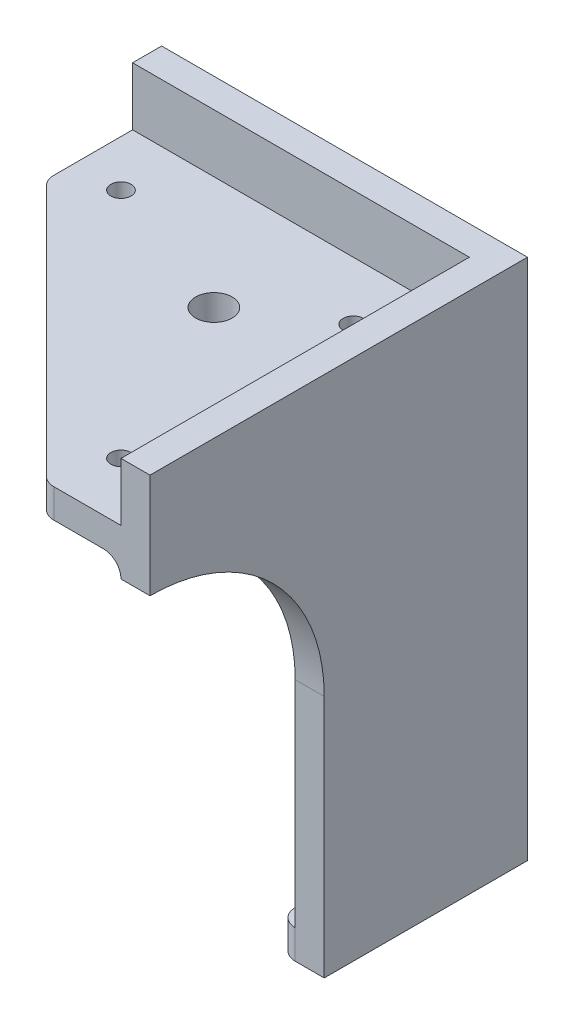
ISO-10303-21;
HEADER;
FILE_DESCRIPTION(('STEP AP214'),'2;1');
FILE_NAME('part.step','',(''),(''),'','','');
FILE_SCHEMA(('AUTOMOTIVE_DESIGN { 1 0 10303 214 1 1 1 1 }'));
ENDSEC;
DATA;
#1=APPLICATION_CONTEXT('core data for automotive mechanical design processes');
#2=APPLICATION_PROTOCOL_DEFINITION('international standard','automotive_design',2000,#1);
#3=PRODUCT_CONTEXT('',#1,'mechanical');
#4=PRODUCT('Part','Part','',(#3));
#5=PRODUCT_RELATED_PRODUCT_CATEGORY('part','',(#4));
#6=PRODUCT_DEFINITION_FORMATION('','',#4);
#7=PRODUCT_DEFINITION_CONTEXT('part definition',#1,'design');
#8=PRODUCT_DEFINITION('design','',#6,#7);
#9=PRODUCT_DEFINITION_SHAPE('','',#8);
#10=(LENGTH_UNIT() NAMED_UNIT(*) SI_UNIT(.MILLI.,.METRE.));
#11=(NAMED_UNIT(*) PLANE_ANGLE_UNIT() SI_UNIT($,.RADIAN.));
#12=(NAMED_UNIT(*) SI_UNIT($,.STERADIAN.) SOLID_ANGLE_UNIT());
#13=UNCERTAINTY_MEASURE_WITH_UNIT(LENGTH_MEASURE(1.E-05),#10,'distance_accuracy_value','');
#14=(GEOMETRIC_REPRESENTATION_CONTEXT(3) GLOBAL_UNCERTAINTY_ASSIGNED_CONTEXT((#13)) GLOBAL_UNIT_ASSIGNED_CONTEXT((#10,
#11,#12)) REPRESENTATION_CONTEXT('',''));
#15=CARTESIAN_POINT('',(0.,0.,0.));
#16=DIRECTION('',(0.,0.,1.));
#17=DIRECTION('',(1.,0.,0.));
#18=AXIS2_PLACEMENT_3D('',#15,#16,#17);
#19=CARTESIAN_POINT('',(-63.,-48.,5.));
#20=DIRECTION('',(0.,0.,1.));
#21=DIRECTION('',(1.,0.,0.));
#22=AXIS2_PLACEMENT_3D('',#19,#20,#21);
#23=PLANE('',#22);
#24=DIRECTION('',(0.,-1.,0.));
#25=VECTOR('',#24,1.);
#26=CARTESIAN_POINT('',(-7.99999999999996,-48.,5.));
#27=LINE('',#26,#25);
#28=CARTESIAN_POINT('',(-7.99999999999996,-85.,5.));
#29=VERTEX_POINT('',#28);
#30=CARTESIAN_POINT('',(-7.99999999999997,-18.,5.));
#31=VERTEX_POINT('',#30);
#32=EDGE_CURVE('E322',#29,#31,#27,.F.);
#33=ORIENTED_EDGE('',*,*,#32,.T.);
#34=DIRECTION('',(1.,0.,0.));
#35=VECTOR('',#34,1.);
#36=CARTESIAN_POINT('',(-63.,-18.,5.));
#37=LINE('',#36,#35);
#38=CARTESIAN_POINT('',(-63.,-18.,5.));
#39=VERTEX_POINT('',#38);
#40=EDGE_CURVE('E324',#31,#39,#37,.F.);
#41=ORIENTED_EDGE('',*,*,#40,.T.);
#42=CARTESIAN_POINT('',(-63.,-48.,5.));
#43=DIRECTION('',(0.,0.,-1.));
#44=DIRECTION('',(1.,0.,0.));
#45=AXIS2_PLACEMENT_3D('',#42,#43,#44);
#46=CIRCLE('',#45,30.);
#47=CARTESIAN_POINT('',(-33.,-48.,5.));
#48=VERTEX_POINT('',#47);
#49=EDGE_CURVE('E234',#39,#48,#46,.T.);
#50=ORIENTED_EDGE('',*,*,#49,.T.);
#51=DIRECTION('',(0.,-1.,0.));
#52=VECTOR('',#51,1.);
#53=CARTESIAN_POINT('',(-33.,-90.,5.));
#54=LINE('',#53,#52);
#55=CARTESIAN_POINT('',(-33.,-85.,5.));
#56=VERTEX_POINT('',#55);
#57=EDGE_CURVE('E237',#48,#56,#54,.T.);
#58=ORIENTED_EDGE('',*,*,#57,.T.);
#59=DIRECTION('',(1.,0.,0.));
#60=VECTOR('',#59,1.);
#61=CARTESIAN_POINT('',(-33.,-85.,5.));
#62=LINE('',#61,#60);
#63=EDGE_CURVE('E356',#56,#29,#62,.T.);
#64=ORIENTED_EDGE('',*,*,#63,.T.);
#65=EDGE_LOOP('',(#33,#41,#50,#58,#64));
#66=FACE_BOUND('',#65,.T.);
#67=ADVANCED_FACE('F33',(#66),#23,.T.);
#68=DIRECTION('',(0.,-1.,0.));
#69=VECTOR('',#68,1.);
#70=CARTESIAN_POINT('',(-63.,-18.,5.));
#71=LINE('',#70,#69);
#72=CARTESIAN_POINT('',(-63.,0.,5.));
#73=VERTEX_POINT('',#72);
#74=CARTESIAN_POINT('',(-63.,-10.,5.));
#75=VERTEX_POINT('',#74);
#76=EDGE_CURVE('E206',#73,#75,#71,.T.);
#77=ORIENTED_EDGE('',*,*,#76,.T.);
#78=DIRECTION('',(-1.,0.,0.));
#79=VECTOR('',#78,1.);
#80=CARTESIAN_POINT('',(-4.99999999999996,-10.,5.));
#81=LINE('',#80,#79);
#82=CARTESIAN_POINT('',(-4.99999999999996,-10.,5.));
#83=VERTEX_POINT('',#82);
#84=EDGE_CURVE('E190',#83,#75,#81,.T.);
#85=ORIENTED_EDGE('',*,*,#84,.F.);
#86=DIRECTION('',(0.,-1.,0.));
#87=VECTOR('',#86,1.);
#88=CARTESIAN_POINT('',(-4.99999999999997,0.,5.));
#89=LINE('',#88,#87);
#90=CARTESIAN_POINT('',(-4.99999999999996,0.,5.));
#91=VERTEX_POINT('',#90);
#92=EDGE_CURVE('E203',#91,#83,#89,.T.);
#93=ORIENTED_EDGE('',*,*,#92,.F.);
#94=DIRECTION('',(-1.,0.,0.));
#95=VECTOR('',#94,1.);
#96=CARTESIAN_POINT('',(-63.,0.,5.));
#97=LINE('',#96,#95);
#98=EDGE_CURVE('E224',#91,#73,#97,.T.);
#99=ORIENTED_EDGE('',*,*,#98,.T.);
#100=EDGE_LOOP('',(#77,#85,#93,#99));
#101=FACE_BOUND('',#100,.T.);
#102=ADVANCED_FACE('F202',(#101),#23,.T.);
#103=CARTESIAN_POINT('',(-4.99999999999997,0.,65.));
#104=DIRECTION('',(1.,0.,0.));
#105=DIRECTION('',(0.,1.,0.));
#106=AXIS2_PLACEMENT_3D('',#103,#104,#105);
#107=PLANE('',#106);
#108=CARTESIAN_POINT('',(-4.99999999999998,-48.,65.));
#109=DIRECTION('',(1.,0.,0.));
#110=DIRECTION('',(0.,1.,0.));
#111=AXIS2_PLACEMENT_3D('',#108,#109,#110);
#112=CIRCLE('',#111,30.);
#113=CARTESIAN_POINT('',(-4.99999999999998,-18.,65.));
#114=VERTEX_POINT('',#113);
#115=CARTESIAN_POINT('',(-4.99999999999997,-48.,35.));
#116=VERTEX_POINT('',#115);
#117=EDGE_CURVE('E215',#114,#116,#112,.F.);
#118=ORIENTED_EDGE('',*,*,#117,.F.);
#119=DIRECTION('',(0.,0.,-1.));
#120=VECTOR('',#119,1.);
#121=CARTESIAN_POINT('',(-4.99999999999997,-18.,5.));
#122=LINE('',#121,#120);
#123=CARTESIAN_POINT('',(-4.99999999999997,-18.,8.));
#124=VERTEX_POINT('',#123);
#125=EDGE_CURVE('E50',#114,#124,#122,.T.);
#126=ORIENTED_EDGE('',*,*,#125,.T.);
#127=DIRECTION('',(0.,-1.,0.));
#128=VECTOR('',#127,1.);
#129=CARTESIAN_POINT('',(-4.99999999999997,0.,8.));
#130=LINE('',#129,#128);
#131=CARTESIAN_POINT('',(-4.99999999999996,-85.,8.));
#132=VERTEX_POINT('',#131);
#133=EDGE_CURVE('E54',#124,#132,#130,.T.);
#134=ORIENTED_EDGE('',*,*,#133,.T.);
#135=DIRECTION('',(0.,0.,1.));
#136=VECTOR('',#135,1.);
#137=CARTESIAN_POINT('',(-4.99999999999996,-85.,5.));
#138=LINE('',#137,#136);
#139=CARTESIAN_POINT('',(-4.99999999999996,-85.,35.));
#140=VERTEX_POINT('',#139);
#141=EDGE_CURVE('E359',#132,#140,#138,.T.);
#142=ORIENTED_EDGE('',*,*,#141,.T.);
#143=DIRECTION('',(0.,-1.,0.));
#144=VECTOR('',#143,1.);
#145=CARTESIAN_POINT('',(-4.99999999999996,-90.,35.));
#146=LINE('',#145,#144);
#147=EDGE_CURVE('E219',#116,#140,#146,.T.);
#148=ORIENTED_EDGE('',*,*,#147,.F.);
#149=EDGE_LOOP('',(#118,#126,#134,#142,#148));
#150=FACE_BOUND('',#149,.T.);
#151=ADVANCED_FACE('F427',(#150),#107,.F.);
#152=DIRECTION('',(0.,0.,-1.));
#153=VECTOR('',#152,1.);
#154=CARTESIAN_POINT('',(-4.99999999999996,-10.,123.215118311312));
#155=LINE('',#154,#153);
#156=CARTESIAN_POINT('',(-4.99999999999996,-10.,65.));
#157=VERTEX_POINT('',#156);
#158=EDGE_CURVE('E185',#157,#83,#155,.T.);
#159=ORIENTED_EDGE('',*,*,#158,.F.);
#160=DIRECTION('',(0.,-1.,0.));
#161=VECTOR('',#160,1.);
#162=CARTESIAN_POINT('',(-4.99999999999997,0.,65.));
#163=LINE('',#162,#161);
#164=CARTESIAN_POINT('',(-4.99999999999997,0.,65.));
#165=VERTEX_POINT('',#164);
#166=EDGE_CURVE('E231',#165,#157,#163,.T.);
#167=ORIENTED_EDGE('',*,*,#166,.F.);
#168=DIRECTION('',(0.,0.,-1.));
#169=VECTOR('',#168,1.);
#170=CARTESIAN_POINT('',(-4.99999999999997,0.,65.));
#171=LINE('',#170,#169);
#172=EDGE_CURVE('E213',#165,#91,#171,.T.);
#173=ORIENTED_EDGE('',*,*,#172,.T.);
#174=ORIENTED_EDGE('',*,*,#92,.T.);
#175=EDGE_LOOP('',(#159,#167,#173,#174));
#176=FACE_BOUND('',#175,.T.);
#177=ADVANCED_FACE('F211',(#176),#107,.F.);
#178=CARTESIAN_POINT('',(-63.,-18.,5.));
#179=DIRECTION('',(1.,0.,0.));
#180=DIRECTION('',(0.,1.,0.));
#181=AXIS2_PLACEMENT_3D('',#178,#179,#180);
#182=PLANE('',#181);
#183=DIRECTION('',(0.,0.,-1.));
#184=VECTOR('',#183,1.);
#185=CARTESIAN_POINT('',(-63.,-15.,123.215118311312));
#186=LINE('',#185,#184);
#187=CARTESIAN_POINT('',(-63.,-15.,18.575));
#188=VERTEX_POINT('',#187);
#189=CARTESIAN_POINT('',(-63.,-15.,8.00000000000004));
#190=VERTEX_POINT('',#189);
#191=EDGE_CURVE('E207',#188,#190,#186,.T.);
#192=ORIENTED_EDGE('',*,*,#191,.F.);
#193=DIRECTION('',(0.,1.,0.));
#194=VECTOR('',#193,1.);
#195=CARTESIAN_POINT('',(-63.,-18.,18.575));
#196=LINE('',#195,#194);
#197=CARTESIAN_POINT('',(-63.,-10.,18.575));
#198=VERTEX_POINT('',#197);
#199=EDGE_CURVE('E314',#188,#198,#196,.T.);
#200=ORIENTED_EDGE('',*,*,#199,.T.);
#201=DIRECTION('',(0.,0.,-1.));
#202=VECTOR('',#201,1.);
#203=CARTESIAN_POINT('',(-63.,-10.,123.215118311312));
#204=LINE('',#203,#202);
#205=EDGE_CURVE('E199',#198,#75,#204,.T.);
#206=ORIENTED_EDGE('',*,*,#205,.T.);
#207=ORIENTED_EDGE('',*,*,#76,.F.);
#208=DIRECTION('',(0.,0.,-1.));
#209=VECTOR('',#208,1.);
#210=CARTESIAN_POINT('',(-63.,0.,5.));
#211=LINE('',#210,#209);
#212=CARTESIAN_POINT('',(-63.,0.,0.));
#213=VERTEX_POINT('',#212);
#214=EDGE_CURVE('E255',#73,#213,#211,.T.);
#215=ORIENTED_EDGE('',*,*,#214,.T.);
#216=DIRECTION('',(0.,-1.,0.));
#217=VECTOR('',#216,1.);
#218=CARTESIAN_POINT('',(-63.,-18.,0.));
#219=LINE('',#218,#217);
#220=CARTESIAN_POINT('',(-63.,-18.,0.));
#221=VERTEX_POINT('',#220);
#222=EDGE_CURVE('E241',#213,#221,#219,.T.);
#223=ORIENTED_EDGE('',*,*,#222,.T.);
#224=DIRECTION('',(0.,0.,-1.));
#225=VECTOR('',#224,1.);
#226=CARTESIAN_POINT('',(-63.,-18.,5.));
#227=LINE('',#226,#225);
#228=EDGE_CURVE('E267',#39,#221,#227,.T.);
#229=ORIENTED_EDGE('',*,*,#228,.F.);
#230=CARTESIAN_POINT('',(-63.,-18.,8.00000000000001));
#231=DIRECTION('',(1.,0.,0.));
#232=DIRECTION('',(0.,1.,0.));
#233=AXIS2_PLACEMENT_3D('',#230,#231,#232);
#234=CIRCLE('',#233,3.);
#235=EDGE_CURVE('E42',#39,#190,#234,.T.);
#236=ORIENTED_EDGE('',*,*,#235,.T.);
#237=EDGE_LOOP('',(#192,#200,#206,#207,#215,#223,#229,#236));
#238=FACE_BOUND('',#237,.T.);
#239=ADVANCED_FACE('F404',(#238),#182,.F.);
#240=CARTESIAN_POINT('',(-63.,-48.,5.));
#241=DIRECTION('',(0.,0.,-1.));
#242=DIRECTION('',(-1.,0.,0.));
#243=AXIS2_PLACEMENT_3D('',#240,#241,#242);
#244=CYLINDRICAL_SURFACE('',#243,30.);
#245=CARTESIAN_POINT('',(-63.,-48.,0.));
#246=DIRECTION('',(0.,0.,-1.));
#247=DIRECTION('',(1.,0.,0.));
#248=AXIS2_PLACEMENT_3D('',#245,#246,#247);
#249=CIRCLE('',#248,30.);
#250=CARTESIAN_POINT('',(-33.,-48.,0.));
#251=VERTEX_POINT('',#250);
#252=EDGE_CURVE('E244',#221,#251,#249,.T.);
#253=ORIENTED_EDGE('',*,*,#252,.T.);
#254=DIRECTION('',(0.,0.,-1.));
#255=VECTOR('',#254,1.);
#256=CARTESIAN_POINT('',(-33.,-48.,5.));
#257=LINE('',#256,#255);
#258=EDGE_CURVE('E265',#48,#251,#257,.T.);
#259=ORIENTED_EDGE('',*,*,#258,.F.);
#260=ORIENTED_EDGE('',*,*,#49,.F.);
#261=ORIENTED_EDGE('',*,*,#228,.T.);
#262=EDGE_LOOP('',(#253,#259,#260,#261));
#263=FACE_BOUND('',#262,.T.);
#264=ADVANCED_FACE('F450',(#263),#244,.F.);
#265=CARTESIAN_POINT('',(-33.,-90.,5.));
#266=DIRECTION('',(1.,0.,0.));
#267=DIRECTION('',(0.,0.,-1.));
#268=AXIS2_PLACEMENT_3D('',#265,#266,#267);
#269=PLANE('',#268);
#270=DIRECTION('',(0.,0.,-1.));
#271=VECTOR('',#270,1.);
#272=CARTESIAN_POINT('',(-33.,-90.,5.));
#273=LINE('',#272,#271);
#274=CARTESIAN_POINT('',(-33.,-90.,5.));
#275=VERTEX_POINT('',#274);
#276=CARTESIAN_POINT('',(-33.,-90.,0.));
#277=VERTEX_POINT('',#276);
#278=EDGE_CURVE('E263',#275,#277,#273,.T.);
#279=ORIENTED_EDGE('',*,*,#278,.F.);
#280=DIRECTION('',(0.,-1.,0.));
#281=VECTOR('',#280,1.);
#282=CARTESIAN_POINT('',(-33.,-85.,5.));
#283=LINE('',#282,#281);
#284=EDGE_CURVE('E286',#275,#56,#283,.F.);
#285=ORIENTED_EDGE('',*,*,#284,.T.);
#286=ORIENTED_EDGE('',*,*,#57,.F.);
#287=ORIENTED_EDGE('',*,*,#258,.T.);
#288=DIRECTION('',(0.,-1.,0.));
#289=VECTOR('',#288,1.);
#290=CARTESIAN_POINT('',(-33.,-90.,0.));
#291=LINE('',#290,#289);
#292=EDGE_CURVE('E246',#251,#277,#291,.T.);
#293=ORIENTED_EDGE('',*,*,#292,.T.);
#294=EDGE_LOOP('',(#279,#285,#286,#287,#293));
#295=FACE_BOUND('',#294,.T.);
#296=ADVANCED_FACE('F446',(#295),#269,.F.);
#297=CARTESIAN_POINT('',(0.,-90.,5.));
#298=DIRECTION('',(0.,1.,0.));
#299=DIRECTION('',(0.,0.,1.));
#300=AXIS2_PLACEMENT_3D('',#297,#298,#299);
#301=PLANE('',#300);
#302=DIRECTION('',(-1.,0.,0.));
#303=VECTOR('',#302,1.);
#304=CARTESIAN_POINT('',(-33.,-90.,8.));
#305=LINE('',#304,#303);
#306=CARTESIAN_POINT('',(-7.99999999999996,-90.,8.));
#307=VERTEX_POINT('',#306);
#308=CARTESIAN_POINT('',(-30.,-90.,8.));
#309=VERTEX_POINT('',#308);
#310=EDGE_CURVE('E360',#307,#309,#305,.T.);
#311=ORIENTED_EDGE('',*,*,#310,.T.);
#312=CARTESIAN_POINT('',(-30.,-90.,5.));
#313=DIRECTION('',(0.,1.,0.));
#314=DIRECTION('',(0.,0.,1.));
#315=AXIS2_PLACEMENT_3D('',#312,#313,#314);
#316=CIRCLE('',#315,3.);
#317=EDGE_CURVE('E281',#309,#275,#316,.F.);
#318=ORIENTED_EDGE('',*,*,#317,.T.);
#319=ORIENTED_EDGE('',*,*,#278,.T.);
#320=DIRECTION('',(1.,0.,0.));
#321=VECTOR('',#320,1.);
#322=CARTESIAN_POINT('',(0.,-90.,0.));
#323=LINE('',#322,#321);
#324=CARTESIAN_POINT('',(0.,-90.,0.));
#325=VERTEX_POINT('',#324);
#326=EDGE_CURVE('E249',#277,#325,#323,.T.);
#327=ORIENTED_EDGE('',*,*,#326,.T.);
#328=DIRECTION('',(0.,0.,-1.));
#329=VECTOR('',#328,1.);
#330=CARTESIAN_POINT('',(0.,-90.,5.));
#331=LINE('',#330,#329);
#332=CARTESIAN_POINT('',(0.,-90.,35.));
#333=VERTEX_POINT('',#332);
#334=EDGE_CURVE('E261',#333,#325,#331,.T.);
#335=ORIENTED_EDGE('',*,*,#334,.F.);
#336=DIRECTION('',(1.,0.,0.));
#337=VECTOR('',#336,1.);
#338=CARTESIAN_POINT('',(-82.9999999999999,-90.,35.));
#339=LINE('',#338,#337);
#340=CARTESIAN_POINT('',(-4.99999999999996,-90.,35.));
#341=VERTEX_POINT('',#340);
#342=EDGE_CURVE('E379',#341,#333,#339,.T.);
#343=ORIENTED_EDGE('',*,*,#342,.F.);
#344=CARTESIAN_POINT('',(-4.99999999999996,-90.,32.));
#345=DIRECTION('',(0.,1.,0.));
#346=DIRECTION('',(0.,0.,1.));
#347=AXIS2_PLACEMENT_3D('',#344,#345,#346);
#348=CIRCLE('',#347,3.);
#349=CARTESIAN_POINT('',(-7.99999999999996,-90.,32.));
#350=VERTEX_POINT('',#349);
#351=EDGE_CURVE('E274',#341,#350,#348,.F.);
#352=ORIENTED_EDGE('',*,*,#351,.T.);
#353=DIRECTION('',(0.,0.,-1.));
#354=VECTOR('',#353,1.);
#355=CARTESIAN_POINT('',(-7.99999999999996,-90.,8.));
#356=LINE('',#355,#354);
#357=EDGE_CURVE('E350',#350,#307,#356,.T.);
#358=ORIENTED_EDGE('',*,*,#357,.T.);
#359=EDGE_LOOP('',(#311,#318,#319,#327,#335,#343,#352,#358));
#360=FACE_BOUND('',#359,.T.);
#361=ADVANCED_FACE('F442',(#360),#301,.F.);
#362=CARTESIAN_POINT('',(0.,0.,5.));
#363=DIRECTION('',(-1.,0.,0.));
#364=DIRECTION('',(0.,-1.,0.));
#365=AXIS2_PLACEMENT_3D('',#362,#363,#364);
#366=PLANE('',#365);
#367=DIRECTION('',(0.,1.,0.));
#368=VECTOR('',#367,1.);
#369=CARTESIAN_POINT('',(0.,0.,65.));
#370=LINE('',#369,#368);
#371=CARTESIAN_POINT('',(0.,-18.,65.));
#372=VERTEX_POINT('',#371);
#373=CARTESIAN_POINT('',(0.,0.,65.));
#374=VERTEX_POINT('',#373);
#375=EDGE_CURVE('E214',#372,#374,#370,.T.);
#376=ORIENTED_EDGE('',*,*,#375,.F.);
#377=CARTESIAN_POINT('',(0.,-48.,65.));
#378=DIRECTION('',(1.,0.,0.));
#379=DIRECTION('',(0.,1.,0.));
#380=AXIS2_PLACEMENT_3D('',#377,#378,#379);
#381=CIRCLE('',#380,30.);
#382=CARTESIAN_POINT('',(0.,-48.,35.));
#383=VERTEX_POINT('',#382);
#384=EDGE_CURVE('E377',#383,#372,#381,.T.);
#385=ORIENTED_EDGE('',*,*,#384,.F.);
#386=DIRECTION('',(0.,1.,0.));
#387=VECTOR('',#386,1.);
#388=CARTESIAN_POINT('',(0.,-90.,35.));
#389=LINE('',#388,#387);
#390=EDGE_CURVE('E371',#333,#383,#389,.T.);
#391=ORIENTED_EDGE('',*,*,#390,.F.);
#392=ORIENTED_EDGE('',*,*,#334,.T.);
#393=DIRECTION('',(0.,1.,0.));
#394=VECTOR('',#393,1.);
#395=CARTESIAN_POINT('',(0.,0.,0.));
#396=LINE('',#395,#394);
#397=CARTESIAN_POINT('',(0.,0.,0.));
#398=VERTEX_POINT('',#397);
#399=EDGE_CURVE('E252',#325,#398,#396,.T.);
#400=ORIENTED_EDGE('',*,*,#399,.T.);
#401=DIRECTION('',(0.,0.,-1.));
#402=VECTOR('',#401,1.);
#403=CARTESIAN_POINT('',(0.,0.,5.));
#404=LINE('',#403,#402);
#405=EDGE_CURVE('E258',#374,#398,#404,.T.);
#406=ORIENTED_EDGE('',*,*,#405,.F.);
#407=EDGE_LOOP('',(#376,#385,#391,#392,#400,#406));
#408=FACE_BOUND('',#407,.T.);
#409=ADVANCED_FACE('F438',(#408),#366,.F.);
#410=CARTESIAN_POINT('',(-63.,0.,5.));
#411=DIRECTION('',(0.,-1.,0.));
#412=DIRECTION('',(0.,0.,-1.));
#413=AXIS2_PLACEMENT_3D('',#410,#411,#412);
#414=PLANE('',#413);
#415=DIRECTION('',(-1.,0.,0.));
#416=VECTOR('',#415,1.);
#417=CARTESIAN_POINT('',(-63.,0.,0.));
#418=LINE('',#417,#416);
#419=EDGE_CURVE('E235',#398,#213,#418,.T.);
#420=ORIENTED_EDGE('',*,*,#419,.T.);
#421=ORIENTED_EDGE('',*,*,#214,.F.);
#422=ORIENTED_EDGE('',*,*,#98,.F.);
#423=ORIENTED_EDGE('',*,*,#172,.F.);
#424=DIRECTION('',(-1.,0.,0.));
#425=VECTOR('',#424,1.);
#426=CARTESIAN_POINT('',(0.,0.,65.));
#427=LINE('',#426,#425);
#428=EDGE_CURVE('E217',#374,#165,#427,.T.);
#429=ORIENTED_EDGE('',*,*,#428,.F.);
#430=ORIENTED_EDGE('',*,*,#405,.T.);
#431=EDGE_LOOP('',(#420,#421,#422,#423,#429,#430));
#432=FACE_BOUND('',#431,.T.);
#433=ADVANCED_FACE('F434',(#432),#414,.F.);
#434=CARTESIAN_POINT('',(-63.,-48.,0.));
#435=DIRECTION('',(0.,0.,1.));
#436=DIRECTION('',(1.,0.,0.));
#437=AXIS2_PLACEMENT_3D('',#434,#435,#436);
#438=PLANE('',#437);
#439=ORIENTED_EDGE('',*,*,#222,.F.);
#440=ORIENTED_EDGE('',*,*,#419,.F.);
#441=ORIENTED_EDGE('',*,*,#399,.F.);
#442=ORIENTED_EDGE('',*,*,#326,.F.);
#443=ORIENTED_EDGE('',*,*,#292,.F.);
#444=ORIENTED_EDGE('',*,*,#252,.F.);
#445=EDGE_LOOP('',(#439,#440,#441,#442,#443,#444));
#446=FACE_BOUND('',#445,.T.);
#447=ADVANCED_FACE('F431',(#446),#438,.F.);
#448=CARTESIAN_POINT('',(0.,0.,65.));
#449=DIRECTION('',(0.,0.,-1.));
#450=DIRECTION('',(-1.,0.,0.));
#451=AXIS2_PLACEMENT_3D('',#448,#449,#450);
#452=PLANE('',#451);
#453=DIRECTION('',(1.,0.,0.));
#454=VECTOR('',#453,1.);
#455=CARTESIAN_POINT('',(-4.99999999999996,-10.,65.));
#456=LINE('',#455,#454);
#457=CARTESIAN_POINT('',(-16.5750000000005,-10.,65.));
#458=VERTEX_POINT('',#457);
#459=EDGE_CURVE('E193',#458,#157,#456,.T.);
#460=ORIENTED_EDGE('',*,*,#459,.F.);
#461=DIRECTION('',(0.,1.,0.));
#462=VECTOR('',#461,1.);
#463=CARTESIAN_POINT('',(-16.5750000000005,0.,65.));
#464=LINE('',#463,#462);
#465=CARTESIAN_POINT('',(-16.5750000000005,-15.,65.));
#466=VERTEX_POINT('',#465);
#467=EDGE_CURVE('E307',#458,#466,#464,.F.);
#468=ORIENTED_EDGE('',*,*,#467,.T.);
#469=DIRECTION('',(-1.,0.,0.));
#470=VECTOR('',#469,1.);
#471=CARTESIAN_POINT('',(-4.99999999999996,-15.,65.));
#472=LINE('',#471,#470);
#473=CARTESIAN_POINT('',(-7.99999999999997,-15.,65.));
#474=VERTEX_POINT('',#473);
#475=EDGE_CURVE('E198',#474,#466,#472,.T.);
#476=ORIENTED_EDGE('',*,*,#475,.F.);
#477=CARTESIAN_POINT('',(-7.99999999999997,-18.,65.));
#478=DIRECTION('',(0.,0.,-1.));
#479=DIRECTION('',(-1.,0.,0.));
#480=AXIS2_PLACEMENT_3D('',#477,#478,#479);
#481=CIRCLE('',#480,3.);
#482=EDGE_CURVE('E11',#474,#114,#481,.T.);
#483=ORIENTED_EDGE('',*,*,#482,.T.);
#484=DIRECTION('',(1.,0.,0.));
#485=VECTOR('',#484,1.);
#486=CARTESIAN_POINT('',(-83.,-18.,65.));
#487=LINE('',#486,#485);
#488=EDGE_CURVE('E373',#114,#372,#487,.T.);
#489=ORIENTED_EDGE('',*,*,#488,.T.);
#490=ORIENTED_EDGE('',*,*,#375,.T.);
#491=ORIENTED_EDGE('',*,*,#428,.T.);
#492=ORIENTED_EDGE('',*,*,#166,.T.);
#493=EDGE_LOOP('',(#460,#468,#476,#483,#489,#490,#491,#492));
#494=FACE_BOUND('',#493,.T.);
#495=ADVANCED_FACE('F386',(#494),#452,.F.);
#496=CARTESIAN_POINT('',(-82.9999999999999,-48.,65.));
#497=DIRECTION('',(1.,0.,0.));
#498=DIRECTION('',(0.,1.,0.));
#499=AXIS2_PLACEMENT_3D('',#496,#497,#498);
#500=CYLINDRICAL_SURFACE('',#499,30.);
#501=ORIENTED_EDGE('',*,*,#117,.T.);
#502=DIRECTION('',(1.,0.,0.));
#503=VECTOR('',#502,1.);
#504=CARTESIAN_POINT('',(-82.9999999999999,-48.,35.));
#505=LINE('',#504,#503);
#506=EDGE_CURVE('E382',#116,#383,#505,.T.);
#507=ORIENTED_EDGE('',*,*,#506,.T.);
#508=ORIENTED_EDGE('',*,*,#384,.T.);
#509=ORIENTED_EDGE('',*,*,#488,.F.);
#510=EDGE_LOOP('',(#501,#507,#508,#509));
#511=FACE_BOUND('',#510,.T.);
#512=ADVANCED_FACE('F574',(#511),#500,.F.);
#513=CARTESIAN_POINT('',(-82.9999999999999,-90.,35.));
#514=DIRECTION('',(0.,0.,-1.));
#515=DIRECTION('',(0.,1.,0.));
#516=AXIS2_PLACEMENT_3D('',#513,#514,#515);
#517=PLANE('',#516);
#518=ORIENTED_EDGE('',*,*,#147,.T.);
#519=DIRECTION('',(0.,-1.,0.));
#520=VECTOR('',#519,1.);
#521=CARTESIAN_POINT('',(-4.99999999999996,-90.,35.));
#522=LINE('',#521,#520);
#523=EDGE_CURVE('E293',#140,#341,#522,.T.);
#524=ORIENTED_EDGE('',*,*,#523,.T.);
#525=ORIENTED_EDGE('',*,*,#342,.T.);
#526=ORIENTED_EDGE('',*,*,#390,.T.);
#527=ORIENTED_EDGE('',*,*,#506,.F.);
#528=EDGE_LOOP('',(#518,#524,#525,#526,#527));
#529=FACE_BOUND('',#528,.T.);
#530=ADVANCED_FACE('F643',(#529),#517,.F.);
#531=CARTESIAN_POINT('',(-33.,-85.,8.));
#532=DIRECTION('',(0.,0.,1.));
#533=DIRECTION('',(1.,0.,0.));
#534=AXIS2_PLACEMENT_3D('',#531,#532,#533);
#535=PLANE('',#534);
#536=DIRECTION('',(-1.,0.,0.));
#537=VECTOR('',#536,1.);
#538=CARTESIAN_POINT('',(-33.,-85.,8.));
#539=LINE('',#538,#537);
#540=CARTESIAN_POINT('',(-7.99999999999996,-85.,8.));
#541=VERTEX_POINT('',#540);
#542=CARTESIAN_POINT('',(-30.,-85.,8.));
#543=VERTEX_POINT('',#542);
#544=EDGE_CURVE('E364',#541,#543,#539,.T.);
#545=ORIENTED_EDGE('',*,*,#544,.T.);
#546=DIRECTION('',(0.,-1.,0.));
#547=VECTOR('',#546,1.);
#548=CARTESIAN_POINT('',(-30.,-90.,8.));
#549=LINE('',#548,#547);
#550=EDGE_CURVE('E269',#543,#309,#549,.T.);
#551=ORIENTED_EDGE('',*,*,#550,.T.);
#552=ORIENTED_EDGE('',*,*,#310,.F.);
#553=DIRECTION('',(0.,-1.,0.));
#554=VECTOR('',#553,1.);
#555=CARTESIAN_POINT('',(-7.99999999999996,-85.,8.));
#556=LINE('',#555,#554);
#557=EDGE_CURVE('E366',#541,#307,#556,.T.);
#558=ORIENTED_EDGE('',*,*,#557,.F.);
#559=EDGE_LOOP('',(#545,#551,#552,#558));
#560=FACE_BOUND('',#559,.T.);
#561=ADVANCED_FACE('F634',(#560),#535,.T.);
#562=CARTESIAN_POINT('',(-7.99999999999996,-85.,8.));
#563=DIRECTION('',(-1.,0.,0.));
#564=DIRECTION('',(0.,-1.,0.));
#565=AXIS2_PLACEMENT_3D('',#562,#563,#564);
#566=PLANE('',#565);
#567=ORIENTED_EDGE('',*,*,#357,.F.);
#568=DIRECTION('',(0.,-1.,0.));
#569=VECTOR('',#568,1.);
#570=CARTESIAN_POINT('',(-7.99999999999996,-85.,32.));
#571=LINE('',#570,#569);
#572=CARTESIAN_POINT('',(-7.99999999999996,-85.,32.));
#573=VERTEX_POINT('',#572);
#574=EDGE_CURVE('E296',#350,#573,#571,.F.);
#575=ORIENTED_EDGE('',*,*,#574,.T.);
#576=DIRECTION('',(0.,0.,-1.));
#577=VECTOR('',#576,1.);
#578=CARTESIAN_POINT('',(-7.99999999999996,-85.,8.));
#579=LINE('',#578,#577);
#580=EDGE_CURVE('E362',#573,#541,#579,.T.);
#581=ORIENTED_EDGE('',*,*,#580,.T.);
#582=ORIENTED_EDGE('',*,*,#557,.T.);
#583=EDGE_LOOP('',(#567,#575,#581,#582));
#584=FACE_BOUND('',#583,.T.);
#585=ADVANCED_FACE('F626',(#584),#566,.T.);
#586=CARTESIAN_POINT('',(0.,-85.,0.));
#587=DIRECTION('',(0.,1.,0.));
#588=DIRECTION('',(0.,0.,1.));
#589=AXIS2_PLACEMENT_3D('',#586,#587,#588);
#590=PLANE('',#589);
#591=ORIENTED_EDGE('',*,*,#141,.F.);
#592=CARTESIAN_POINT('',(-7.99999999999996,-85.,8.));
#593=DIRECTION('',(0.,1.,0.));
#594=DIRECTION('',(0.,0.,1.));
#595=AXIS2_PLACEMENT_3D('',#592,#593,#594);
#596=CIRCLE('',#595,3.);
#597=EDGE_CURVE('E328',#132,#29,#596,.T.);
#598=ORIENTED_EDGE('',*,*,#597,.T.);
#599=ORIENTED_EDGE('',*,*,#63,.F.);
#600=CARTESIAN_POINT('',(-30.,-85.,5.));
#601=DIRECTION('',(0.,1.,0.));
#602=DIRECTION('',(0.,0.,1.));
#603=AXIS2_PLACEMENT_3D('',#600,#601,#602);
#604=CIRCLE('',#603,3.);
#605=EDGE_CURVE('E291',#56,#543,#604,.T.);
#606=ORIENTED_EDGE('',*,*,#605,.T.);
#607=ORIENTED_EDGE('',*,*,#544,.F.);
#608=ORIENTED_EDGE('',*,*,#580,.F.);
#609=CARTESIAN_POINT('',(-4.99999999999996,-85.,32.));
#610=DIRECTION('',(0.,1.,0.));
#611=DIRECTION('',(0.,0.,1.));
#612=AXIS2_PLACEMENT_3D('',#609,#610,#611);
#613=CIRCLE('',#612,3.);
#614=EDGE_CURVE('E288',#573,#140,#613,.T.);
#615=ORIENTED_EDGE('',*,*,#614,.T.);
#616=EDGE_LOOP('',(#591,#598,#599,#606,#607,#608,#615));
#617=FACE_BOUND('',#616,.T.);
#618=ADVANCED_FACE('F460',(#617),#590,.T.);
#619=CARTESIAN_POINT('',(-30.,-85.,5.));
#620=DIRECTION('',(0.,1.,0.));
#621=DIRECTION('',(0.,0.,1.));
#622=AXIS2_PLACEMENT_3D('',#619,#620,#621);
#623=CYLINDRICAL_SURFACE('',#622,3.);
#624=ORIENTED_EDGE('',*,*,#605,.F.);
#625=ORIENTED_EDGE('',*,*,#284,.F.);
#626=ORIENTED_EDGE('',*,*,#317,.F.);
#627=ORIENTED_EDGE('',*,*,#550,.F.);
#628=EDGE_LOOP('',(#624,#625,#626,#627));
#629=FACE_BOUND('',#628,.T.);
#630=ADVANCED_FACE('F456',(#629),#623,.T.);
#631=CARTESIAN_POINT('',(-4.99999999999996,-90.,32.));
#632=DIRECTION('',(0.,1.,0.));
#633=DIRECTION('',(0.,0.,1.));
#634=AXIS2_PLACEMENT_3D('',#631,#632,#633);
#635=CYLINDRICAL_SURFACE('',#634,3.);
#636=ORIENTED_EDGE('',*,*,#614,.F.);
#637=ORIENTED_EDGE('',*,*,#574,.F.);
#638=ORIENTED_EDGE('',*,*,#351,.F.);
#639=ORIENTED_EDGE('',*,*,#523,.F.);
#640=EDGE_LOOP('',(#636,#637,#638,#639));
#641=FACE_BOUND('',#640,.T.);
#642=ADVANCED_FACE('F459',(#641),#635,.T.);
#643=CARTESIAN_POINT('',(-4.99999999999996,-15.,123.215118311312));
#644=DIRECTION('',(0.,1.,0.));
#645=DIRECTION('',(-1.,0.,0.));
#646=AXIS2_PLACEMENT_3D('',#643,#644,#645);
#647=PLANE('',#646);
#648=CARTESIAN_POINT('',(-29.5,-15.,24.4999999999999));
#649=DIRECTION('',(0.,1.,0.));
#650=DIRECTION('',(-1.,0.,0.));
#651=AXIS2_PLACEMENT_3D('',#648,#649,#650);
#652=CIRCLE('',#651,3.15);
#653=CARTESIAN_POINT('',(-32.65,-15.,24.4999999999999));
#654=VERTEX_POINT('',#653);
#655=EDGE_CURVE('E759',#654,#654,#652,.F.);
#656=ORIENTED_EDGE('',*,*,#655,.F.);
#657=EDGE_LOOP('',(#656));
#658=FACE_BOUND('',#657,.T.);
#659=CARTESIAN_POINT('',(-55.,-15.,15.));
#660=DIRECTION('',(0.,1.,0.));
#661=DIRECTION('',(-1.,0.,0.));
#662=AXIS2_PLACEMENT_3D('',#659,#660,#661);
#663=CIRCLE('',#662,1.75);
#664=CARTESIAN_POINT('',(-56.75,-15.,15.));
#665=VERTEX_POINT('',#664);
#666=EDGE_CURVE('E763',#665,#665,#663,.F.);
#667=ORIENTED_EDGE('',*,*,#666,.F.);
#668=EDGE_LOOP('',(#667));
#669=FACE_BOUND('',#668,.T.);
#670=CARTESIAN_POINT('',(-15.,-15.,15.));
#671=DIRECTION('',(0.,1.,0.));
#672=DIRECTION('',(-1.,0.,0.));
#673=AXIS2_PLACEMENT_3D('',#670,#671,#672);
#674=CIRCLE('',#673,1.75);
#675=CARTESIAN_POINT('',(-16.75,-15.,15.));
#676=VERTEX_POINT('',#675);
#677=EDGE_CURVE('E767',#676,#676,#674,.F.);
#678=ORIENTED_EDGE('',*,*,#677,.F.);
#679=EDGE_LOOP('',(#678));
#680=FACE_BOUND('',#679,.T.);
#681=CARTESIAN_POINT('',(-15.,-15.,55.));
#682=DIRECTION('',(0.,1.,0.));
#683=DIRECTION('',(-1.,0.,0.));
#684=AXIS2_PLACEMENT_3D('',#681,#682,#683);
#685=CIRCLE('',#684,1.75);
#686=CARTESIAN_POINT('',(-16.75,-15.,55.));
#687=VERTEX_POINT('',#686);
#688=EDGE_CURVE('E333',#687,#687,#685,.F.);
#689=ORIENTED_EDGE('',*,*,#688,.F.);
#690=EDGE_LOOP('',(#689));
#691=FACE_BOUND('',#690,.T.);
#692=ORIENTED_EDGE('',*,*,#191,.T.);
#693=DIRECTION('',(1.,0.,0.));
#694=VECTOR('',#693,1.);
#695=CARTESIAN_POINT('',(-4.99999999999996,-15.,8.00000000000001));
#696=LINE('',#695,#694);
#697=CARTESIAN_POINT('',(-7.99999999999997,-15.,8.00000000000001));
#698=VERTEX_POINT('',#697);
#699=EDGE_CURVE('E319',#190,#698,#696,.T.);
#700=ORIENTED_EDGE('',*,*,#699,.T.);
#701=DIRECTION('',(0.,0.,-1.));
#702=VECTOR('',#701,1.);
#703=CARTESIAN_POINT('',(-7.99999999999997,-15.,65.));
#704=LINE('',#703,#702);
#705=EDGE_CURVE('E317',#698,#474,#704,.F.);
#706=ORIENTED_EDGE('',*,*,#705,.T.);
#707=ORIENTED_EDGE('',*,*,#475,.T.);
#708=CARTESIAN_POINT('',(-16.5750000000005,-15.,62.));
#709=DIRECTION('',(0.,1.,0.));
#710=DIRECTION('',(-1.,0.,0.));
#711=AXIS2_PLACEMENT_3D('',#708,#709,#710);
#712=CIRCLE('',#711,3.);
#713=CARTESIAN_POINT('',(-18.6963203435601,-15.,64.1213203435596));
#714=VERTEX_POINT('',#713);
#715=EDGE_CURVE('E312',#466,#714,#712,.F.);
#716=ORIENTED_EDGE('',*,*,#715,.T.);
#717=DIRECTION('',(0.707106781186544,0.,0.707106781186551));
#718=VECTOR('',#717,1.);
#719=CARTESIAN_POINT('',(-63.,-15.,19.8176406871193));
#720=LINE('',#719,#718);
#721=CARTESIAN_POINT('',(-62.1213203435597,-15.,20.6963203435596));
#722=VERTEX_POINT('',#721);
#723=EDGE_CURVE('E208',#722,#714,#720,.T.);
#724=ORIENTED_EDGE('',*,*,#723,.F.);
#725=CARTESIAN_POINT('',(-60.,-15.,18.575));
#726=DIRECTION('',(0.,1.,0.));
#727=DIRECTION('',(-1.,0.,0.));
#728=AXIS2_PLACEMENT_3D('',#725,#726,#727);
#729=CIRCLE('',#728,3.);
#730=EDGE_CURVE('E310',#722,#188,#729,.F.);
#731=ORIENTED_EDGE('',*,*,#730,.T.);
#732=EDGE_LOOP('',(#692,#700,#706,#707,#716,#724,#731));
#733=FACE_BOUND('',#732,.T.);
#734=ADVANCED_FACE('F395',(#658,#669,#680,#691,#733),#647,.F.);
#735=CARTESIAN_POINT('',(-4.99999999999996,-10.,123.215118311312));
#736=DIRECTION('',(0.,-1.,0.));
#737=DIRECTION('',(1.,0.,0.));
#738=AXIS2_PLACEMENT_3D('',#735,#736,#737);
#739=PLANE('',#738);
#740=CARTESIAN_POINT('',(-29.5,-10.,24.4999999999999));
#741=DIRECTION('',(0.,1.,0.));
#742=DIRECTION('',(-1.,0.,0.));
#743=AXIS2_PLACEMENT_3D('',#740,#741,#742);
#744=CIRCLE('',#743,3.15);
#745=CARTESIAN_POINT('',(-32.65,-10.,24.4999999999999));
#746=VERTEX_POINT('',#745);
#747=EDGE_CURVE('E783',#746,#746,#744,.T.);
#748=ORIENTED_EDGE('',*,*,#747,.F.);
#749=EDGE_LOOP('',(#748));
#750=FACE_BOUND('',#749,.T.);
#751=CARTESIAN_POINT('',(-55.,-10.,15.));
#752=DIRECTION('',(0.,1.,0.));
#753=DIRECTION('',(-1.,0.,0.));
#754=AXIS2_PLACEMENT_3D('',#751,#752,#753);
#755=CIRCLE('',#754,1.75);
#756=CARTESIAN_POINT('',(-56.75,-10.,15.));
#757=VERTEX_POINT('',#756);
#758=EDGE_CURVE('E779',#757,#757,#755,.T.);
#759=ORIENTED_EDGE('',*,*,#758,.F.);
#760=EDGE_LOOP('',(#759));
#761=FACE_BOUND('',#760,.T.);
#762=CARTESIAN_POINT('',(-15.,-10.,15.));
#763=DIRECTION('',(0.,1.,0.));
#764=DIRECTION('',(-1.,0.,0.));
#765=AXIS2_PLACEMENT_3D('',#762,#763,#764);
#766=CIRCLE('',#765,1.75);
#767=CARTESIAN_POINT('',(-16.75,-10.,15.));
#768=VERTEX_POINT('',#767);
#769=EDGE_CURVE('E775',#768,#768,#766,.T.);
#770=ORIENTED_EDGE('',*,*,#769,.F.);
#771=EDGE_LOOP('',(#770));
#772=FACE_BOUND('',#771,.T.);
#773=CARTESIAN_POINT('',(-15.,-10.,55.));
#774=DIRECTION('',(0.,1.,0.));
#775=DIRECTION('',(-1.,0.,0.));
#776=AXIS2_PLACEMENT_3D('',#773,#774,#775);
#777=CIRCLE('',#776,1.75);
#778=CARTESIAN_POINT('',(-16.75,-10.,55.));
#779=VERTEX_POINT('',#778);
#780=EDGE_CURVE('E770',#779,#779,#777,.T.);
#781=ORIENTED_EDGE('',*,*,#780,.F.);
#782=EDGE_LOOP('',(#781));
#783=FACE_BOUND('',#782,.T.);
#784=DIRECTION('',(-0.707106781186544,0.,-0.707106781186551));
#785=VECTOR('',#784,1.);
#786=CARTESIAN_POINT('',(-63.,-10.,19.8176406871193));
#787=LINE('',#786,#785);
#788=CARTESIAN_POINT('',(-18.6963203435601,-10.,64.1213203435596));
#789=VERTEX_POINT('',#788);
#790=CARTESIAN_POINT('',(-62.1213203435597,-10.,20.6963203435596));
#791=VERTEX_POINT('',#790);
#792=EDGE_CURVE('E339',#789,#791,#787,.T.);
#793=ORIENTED_EDGE('',*,*,#792,.F.);
#794=CARTESIAN_POINT('',(-16.5750000000005,-9.99999999999999,62.));
#795=DIRECTION('',(0.,-1.,0.));
#796=DIRECTION('',(1.,0.,0.));
#797=AXIS2_PLACEMENT_3D('',#794,#795,#796);
#798=CIRCLE('',#797,3.);
#799=EDGE_CURVE('E305',#789,#458,#798,.F.);
#800=ORIENTED_EDGE('',*,*,#799,.T.);
#801=ORIENTED_EDGE('',*,*,#459,.T.);
#802=ORIENTED_EDGE('',*,*,#158,.T.);
#803=ORIENTED_EDGE('',*,*,#84,.T.);
#804=ORIENTED_EDGE('',*,*,#205,.F.);
#805=CARTESIAN_POINT('',(-60.,-10.,18.575));
#806=DIRECTION('',(0.,-1.,0.));
#807=DIRECTION('',(1.,0.,0.));
#808=AXIS2_PLACEMENT_3D('',#805,#806,#807);
#809=CIRCLE('',#808,3.);
#810=EDGE_CURVE('E303',#198,#791,#809,.F.);
#811=ORIENTED_EDGE('',*,*,#810,.T.);
#812=EDGE_LOOP('',(#793,#800,#801,#802,#803,#804,#811));
#813=FACE_BOUND('',#812,.T.);
#814=ADVANCED_FACE('F188',(#750,#761,#772,#783,#813),#739,.F.);
#815=CARTESIAN_POINT('',(-63.,-78.8975053202899,19.8176406871193));
#816=DIRECTION('',(0.707106781186551,0.,-0.707106781186544));
#817=DIRECTION('',(-0.707106781186544,0.,-0.707106781186551));
#818=AXIS2_PLACEMENT_3D('',#815,#816,#817);
#819=PLANE('',#818);
#820=ORIENTED_EDGE('',*,*,#723,.T.);
#821=DIRECTION('',(0.,1.,0.));
#822=VECTOR('',#821,1.);
#823=CARTESIAN_POINT('',(-18.6963203435601,-78.8975053202899,64.1213203435596));
#824=LINE('',#823,#822);
#825=EDGE_CURVE('E300',#714,#789,#824,.T.);
#826=ORIENTED_EDGE('',*,*,#825,.T.);
#827=ORIENTED_EDGE('',*,*,#792,.T.);
#828=DIRECTION('',(0.,1.,0.));
#829=VECTOR('',#828,1.);
#830=CARTESIAN_POINT('',(-62.1213203435596,-78.8975053202899,20.6963203435597));
#831=LINE('',#830,#829);
#832=EDGE_CURVE('E298',#791,#722,#831,.F.);
#833=ORIENTED_EDGE('',*,*,#832,.T.);
#834=EDGE_LOOP('',(#820,#826,#827,#833));
#835=FACE_BOUND('',#834,.T.);
#836=ADVANCED_FACE('F397',(#835),#819,.F.);
#837=CARTESIAN_POINT('',(-16.5750000000004,-78.8975053202899,62.));
#838=DIRECTION('',(0.,1.,0.));
#839=DIRECTION('',(-1.,0.,0.));
#840=AXIS2_PLACEMENT_3D('',#837,#838,#839);
#841=CYLINDRICAL_SURFACE('',#840,3.);
#842=ORIENTED_EDGE('',*,*,#715,.F.);
#843=ORIENTED_EDGE('',*,*,#467,.F.);
#844=ORIENTED_EDGE('',*,*,#799,.F.);
#845=ORIENTED_EDGE('',*,*,#825,.F.);
#846=EDGE_LOOP('',(#842,#843,#844,#845));
#847=FACE_BOUND('',#846,.T.);
#848=ADVANCED_FACE('F391',(#847),#841,.T.);
#849=CARTESIAN_POINT('',(-60.,-18.,18.575));
#850=DIRECTION('',(0.,1.,0.));
#851=DIRECTION('',(-1.,0.,0.));
#852=AXIS2_PLACEMENT_3D('',#849,#850,#851);
#853=CYLINDRICAL_SURFACE('',#852,3.);
#854=ORIENTED_EDGE('',*,*,#730,.F.);
#855=ORIENTED_EDGE('',*,*,#832,.F.);
#856=ORIENTED_EDGE('',*,*,#810,.F.);
#857=ORIENTED_EDGE('',*,*,#199,.F.);
#858=EDGE_LOOP('',(#854,#855,#856,#857));
#859=FACE_BOUND('',#858,.T.);
#860=ADVANCED_FACE('F399',(#859),#853,.T.);
#861=CARTESIAN_POINT('',(-7.99999999999997,-18.,65.));
#862=DIRECTION('',(0.,0.,1.));
#863=DIRECTION('',(1.,0.,0.));
#864=AXIS2_PLACEMENT_3D('',#861,#862,#863);
#865=CYLINDRICAL_SURFACE('',#864,3.);
#866=ORIENTED_EDGE('',*,*,#482,.F.);
#867=ORIENTED_EDGE('',*,*,#705,.F.);
#868=CARTESIAN_POINT('',(-7.99999999999997,-18.,8.));
#869=DIRECTION('',(0.,0.,1.));
#870=DIRECTION('',(0.,-1.,0.));
#871=AXIS2_PLACEMENT_3D('',#868,#869,#870);
#872=CIRCLE('',#871,3.);
#873=EDGE_CURVE('E37',#124,#698,#872,.T.);
#874=ORIENTED_EDGE('',*,*,#873,.F.);
#875=ORIENTED_EDGE('',*,*,#125,.F.);
#876=EDGE_LOOP('',(#866,#867,#874,#875));
#877=FACE_BOUND('',#876,.T.);
#878=ADVANCED_FACE('F35',(#877),#865,.F.);
#879=CARTESIAN_POINT('',(-7.99999999999997,0.,8.));
#880=DIRECTION('',(0.,-1.,0.));
#881=DIRECTION('',(1.,0.,0.));
#882=AXIS2_PLACEMENT_3D('',#879,#880,#881);
#883=CYLINDRICAL_SURFACE('',#882,3.);
#884=ORIENTED_EDGE('',*,*,#597,.F.);
#885=ORIENTED_EDGE('',*,*,#133,.F.);
#886=CARTESIAN_POINT('',(-7.99999999999997,-18.,8.));
#887=DIRECTION('',(0.,-1.,0.));
#888=DIRECTION('',(1.,0.,0.));
#889=AXIS2_PLACEMENT_3D('',#886,#887,#888);
#890=CIRCLE('',#889,3.);
#891=EDGE_CURVE('E332',#31,#124,#890,.T.);
#892=ORIENTED_EDGE('',*,*,#891,.F.);
#893=ORIENTED_EDGE('',*,*,#32,.F.);
#894=EDGE_LOOP('',(#884,#885,#892,#893));
#895=FACE_BOUND('',#894,.T.);
#896=ADVANCED_FACE('F413',(#895),#883,.F.);
#897=CARTESIAN_POINT('',(-7.99999999999997,-18.,8.));
#898=DIRECTION('',(0.,0.,1.));
#899=DIRECTION('',(1.,0.,0.));
#900=AXIS2_PLACEMENT_3D('',#897,#898,#899);
#901=SPHERICAL_SURFACE('',#900,3.);
#902=ORIENTED_EDGE('',*,*,#891,.T.);
#903=ORIENTED_EDGE('',*,*,#873,.T.);
#904=CARTESIAN_POINT('',(-7.99999999999997,-18.,8.00000000000001));
#905=DIRECTION('',(-1.,0.,0.));
#906=DIRECTION('',(0.,0.,1.));
#907=AXIS2_PLACEMENT_3D('',#904,#905,#906);
#908=CIRCLE('',#907,3.);
#909=EDGE_CURVE('E331',#31,#698,#908,.F.);
#910=ORIENTED_EDGE('',*,*,#909,.F.);
#911=EDGE_LOOP('',(#902,#903,#910));
#912=FACE_BOUND('',#911,.T.);
#913=ADVANCED_FACE('F418',(#912),#901,.F.);
#914=CARTESIAN_POINT('',(-4.99999999999996,-18.,8.00000000000001));
#915=DIRECTION('',(1.,0.,0.));
#916=DIRECTION('',(0.,1.,0.));
#917=AXIS2_PLACEMENT_3D('',#914,#915,#916);
#918=CYLINDRICAL_SURFACE('',#917,3.);
#919=ORIENTED_EDGE('',*,*,#235,.F.);
#920=ORIENTED_EDGE('',*,*,#40,.F.);
#921=ORIENTED_EDGE('',*,*,#909,.T.);
#922=ORIENTED_EDGE('',*,*,#699,.F.);
#923=EDGE_LOOP('',(#919,#920,#921,#922));
#924=FACE_BOUND('',#923,.T.);
#925=ADVANCED_FACE('F408',(#924),#918,.F.);
#926=CARTESIAN_POINT('',(-15.,-23.9095454429505,55.));
#927=DIRECTION('',(0.,1.,0.));
#928=DIRECTION('',(-1.,0.,0.));
#929=AXIS2_PLACEMENT_3D('',#926,#927,#928);
#930=CYLINDRICAL_SURFACE('',#929,1.75);
#931=ORIENTED_EDGE('',*,*,#688,.T.);
#932=EDGE_LOOP('',(#931));
#933=FACE_BOUND('',#932,.T.);
#934=ORIENTED_EDGE('',*,*,#780,.T.);
#935=EDGE_LOOP('',(#934));
#936=FACE_BOUND('',#935,.T.);
#937=ADVANCED_FACE('F469',(#933,#936),#930,.F.);
#938=CARTESIAN_POINT('',(-15.,-23.9095454429505,15.));
#939=DIRECTION('',(0.,1.,0.));
#940=DIRECTION('',(-1.,0.,0.));
#941=AXIS2_PLACEMENT_3D('',#938,#939,#940);
#942=CYLINDRICAL_SURFACE('',#941,1.75);
#943=ORIENTED_EDGE('',*,*,#677,.T.);
#944=EDGE_LOOP('',(#943));
#945=FACE_BOUND('',#944,.T.);
#946=ORIENTED_EDGE('',*,*,#769,.T.);
#947=EDGE_LOOP('',(#946));
#948=FACE_BOUND('',#947,.T.);
#949=ADVANCED_FACE('F486',(#945,#948),#942,.F.);
#950=CARTESIAN_POINT('',(-55.,-23.9095454429505,15.));
#951=DIRECTION('',(0.,1.,0.));
#952=DIRECTION('',(-1.,0.,0.));
#953=AXIS2_PLACEMENT_3D('',#950,#951,#952);
#954=CYLINDRICAL_SURFACE('',#953,1.75);
#955=ORIENTED_EDGE('',*,*,#666,.T.);
#956=EDGE_LOOP('',(#955));
#957=FACE_BOUND('',#956,.T.);
#958=ORIENTED_EDGE('',*,*,#758,.T.);
#959=EDGE_LOOP('',(#958));
#960=FACE_BOUND('',#959,.T.);
#961=ADVANCED_FACE('F495',(#957,#960),#954,.F.);
#962=CARTESIAN_POINT('',(-29.5,-23.9095454429505,24.4999999999999));
#963=DIRECTION('',(0.,1.,0.));
#964=DIRECTION('',(-1.,0.,0.));
#965=AXIS2_PLACEMENT_3D('',#962,#963,#964);
#966=CYLINDRICAL_SURFACE('',#965,3.15);
#967=ORIENTED_EDGE('',*,*,#655,.T.);
#968=EDGE_LOOP('',(#967));
#969=FACE_BOUND('',#968,.T.);
#970=ORIENTED_EDGE('',*,*,#747,.T.);
#971=EDGE_LOOP('',(#970));
#972=FACE_BOUND('',#971,.T.);
#973=ADVANCED_FACE('F503',(#969,#972),#966,.F.);
#974=CLOSED_SHELL('',(#67,#102,#151,#177,#239,#264,#296,#361,#409,#433,#447,#495,#512,#530,#561,
#585,#618,#630,#642,#734,#814,#836,#848,#860,#878,#896,#913,#925,#937,#949,#961,#973));
#975=MANIFOLD_SOLID_BREP('B2',#974);
#976=ADVANCED_BREP_SHAPE_REPRESENTATION('',(#18,#975),#14);
#977=SHAPE_DEFINITION_REPRESENTATION(#9,#976);
ENDSEC;
END-ISO-10303-21;
